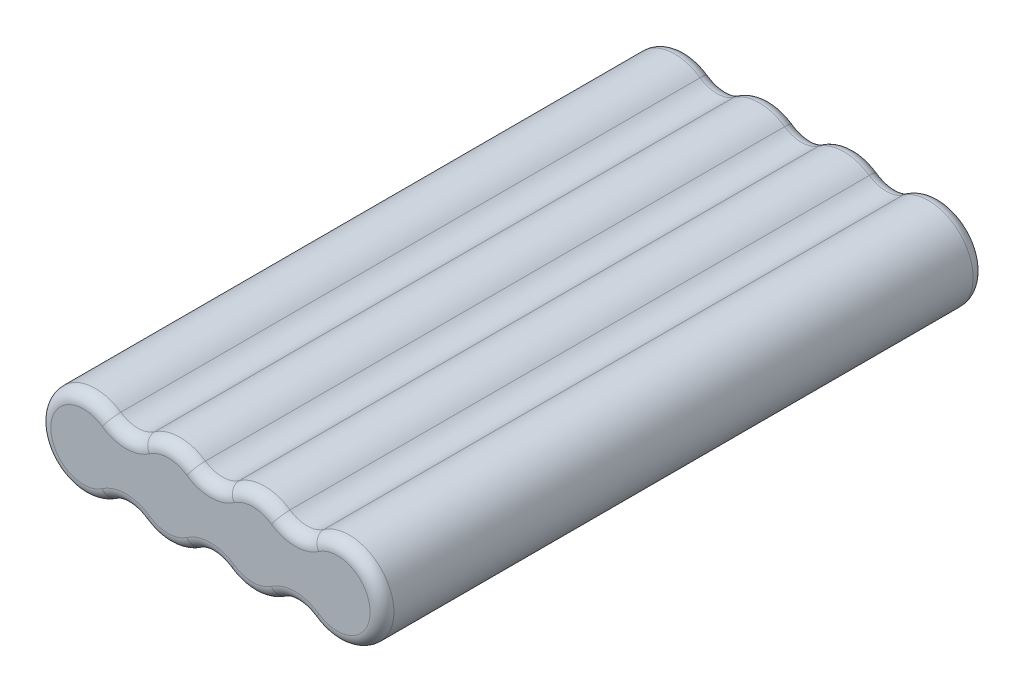
ISO-10303-21;
HEADER;
FILE_DESCRIPTION(('STEP AP214'),'2;1');
FILE_NAME('part.step','',(''),(''),'','','');
FILE_SCHEMA(('AUTOMOTIVE_DESIGN { 1 0 10303 214 1 1 1 1 }'));
ENDSEC;
DATA;
#1=APPLICATION_CONTEXT('core data for automotive mechanical design processes');
#2=APPLICATION_PROTOCOL_DEFINITION('international standard','automotive_design',2000,#1);
#3=PRODUCT_CONTEXT('',#1,'mechanical');
#4=PRODUCT('Part','Part','',(#3));
#5=PRODUCT_RELATED_PRODUCT_CATEGORY('part','',(#4));
#6=PRODUCT_DEFINITION_FORMATION('','',#4);
#7=PRODUCT_DEFINITION_CONTEXT('part definition',#1,'design');
#8=PRODUCT_DEFINITION('design','',#6,#7);
#9=PRODUCT_DEFINITION_SHAPE('','',#8);
#10=(LENGTH_UNIT() NAMED_UNIT(*) SI_UNIT(.MILLI.,.METRE.));
#11=(NAMED_UNIT(*) PLANE_ANGLE_UNIT() SI_UNIT($,.RADIAN.));
#12=(NAMED_UNIT(*) SI_UNIT($,.STERADIAN.) SOLID_ANGLE_UNIT());
#13=UNCERTAINTY_MEASURE_WITH_UNIT(LENGTH_MEASURE(1.E-05),#10,'distance_accuracy_value','');
#14=(GEOMETRIC_REPRESENTATION_CONTEXT(3) GLOBAL_UNCERTAINTY_ASSIGNED_CONTEXT((#13)) GLOBAL_UNIT_ASSIGNED_CONTEXT((#10,
#11,#12)) REPRESENTATION_CONTEXT('',''));
#15=CARTESIAN_POINT('',(0.,0.,0.));
#16=DIRECTION('',(0.,0.,1.));
#17=DIRECTION('',(1.,0.,0.));
#18=AXIS2_PLACEMENT_3D('',#15,#16,#17);
#19=CARTESIAN_POINT('',(14.2193333333333,-10.2811789153233,50.673));
#20=DIRECTION('',(0.,0.,-1.));
#21=DIRECTION('',(-1.,0.,0.));
#22=AXIS2_PLACEMENT_3D('',#19,#20,#21);
#23=CYLINDRICAL_SURFACE('',#22,5.);
#24=DIRECTION('',(0.,0.,-1.));
#25=VECTOR('',#24,1.);
#26=CARTESIAN_POINT('',(11.3754666666667,-6.16870734919399,50.673));
#27=LINE('',#26,#25);
#28=CARTESIAN_POINT('',(11.3754666666667,-6.16870734919399,48.673));
#29=VERTEX_POINT('',#28);
#30=CARTESIAN_POINT('',(11.3754666666667,-6.16870734919399,-48.673));
#31=VERTEX_POINT('',#30);
#32=EDGE_CURVE('E365',#29,#31,#27,.T.);
#33=ORIENTED_EDGE('',*,*,#32,.T.);
#34=CARTESIAN_POINT('',(14.2193333333333,-10.2811789153233,-48.673));
#35=DIRECTION('',(0.,0.,1.));
#36=DIRECTION('',(1.,0.,0.));
#37=AXIS2_PLACEMENT_3D('',#34,#35,#36);
#38=CIRCLE('',#37,5.);
#39=CARTESIAN_POINT('',(17.0632,-6.16870734919399,-48.673));
#40=VERTEX_POINT('',#39);
#41=EDGE_CURVE('E310',#31,#40,#38,.F.);
#42=ORIENTED_EDGE('',*,*,#41,.T.);
#43=DIRECTION('',(0.,0.,-1.));
#44=VECTOR('',#43,1.);
#45=CARTESIAN_POINT('',(17.0632,-6.16870734919399,50.673));
#46=LINE('',#45,#44);
#47=CARTESIAN_POINT('',(17.0632,-6.16870734919399,48.673));
#48=VERTEX_POINT('',#47);
#49=EDGE_CURVE('E225',#48,#40,#46,.T.);
#50=ORIENTED_EDGE('',*,*,#49,.F.);
#51=CARTESIAN_POINT('',(14.2193333333333,-10.2811789153233,48.673));
#52=DIRECTION('',(0.,0.,1.));
#53=DIRECTION('',(1.,0.,0.));
#54=AXIS2_PLACEMENT_3D('',#51,#52,#53);
#55=CIRCLE('',#54,5.);
#56=EDGE_CURVE('E308',#48,#29,#55,.T.);
#57=ORIENTED_EDGE('',*,*,#56,.T.);
#58=EDGE_LOOP('',(#33,#42,#50,#57));
#59=FACE_BOUND('',#58,.T.);
#60=ADVANCED_FACE('F41',(#59),#23,.F.);
#61=CARTESIAN_POINT('',(21.329,0.,50.673));
#62=DIRECTION('',(0.,0.,-1.));
#63=DIRECTION('',(-1.,0.,0.));
#64=AXIS2_PLACEMENT_3D('',#61,#62,#63);
#65=CYLINDRICAL_SURFACE('',#64,7.5);
#66=ORIENTED_EDGE('',*,*,#49,.T.);
#67=CARTESIAN_POINT('',(21.329,0.,-48.673));
#68=DIRECTION('',(0.,0.,1.));
#69=DIRECTION('',(1.,0.,0.));
#70=AXIS2_PLACEMENT_3D('',#67,#68,#69);
#71=CIRCLE('',#70,7.5);
#72=CARTESIAN_POINT('',(17.0632,6.168707349194,-48.673));
#73=VERTEX_POINT('',#72);
#74=EDGE_CURVE('E224',#40,#73,#71,.T.);
#75=ORIENTED_EDGE('',*,*,#74,.T.);
#76=DIRECTION('',(0.,0.,-1.));
#77=VECTOR('',#76,1.);
#78=CARTESIAN_POINT('',(17.0632,6.168707349194,50.673));
#79=LINE('',#78,#77);
#80=CARTESIAN_POINT('',(17.0632,6.168707349194,48.673));
#81=VERTEX_POINT('',#80);
#82=EDGE_CURVE('E206',#81,#73,#79,.T.);
#83=ORIENTED_EDGE('',*,*,#82,.F.);
#84=CARTESIAN_POINT('',(21.329,0.,48.673));
#85=DIRECTION('',(0.,0.,1.));
#86=DIRECTION('',(1.,0.,0.));
#87=AXIS2_PLACEMENT_3D('',#84,#85,#86);
#88=CIRCLE('',#87,7.5);
#89=EDGE_CURVE('E221',#81,#48,#88,.F.);
#90=ORIENTED_EDGE('',*,*,#89,.T.);
#91=EDGE_LOOP('',(#66,#75,#83,#90));
#92=FACE_BOUND('',#91,.T.);
#93=ADVANCED_FACE('F219',(#92),#65,.T.);
#94=CARTESIAN_POINT('',(14.2193333333333,10.2811789153233,50.673));
#95=DIRECTION('',(0.,0.,-1.));
#96=DIRECTION('',(-1.,0.,0.));
#97=AXIS2_PLACEMENT_3D('',#94,#95,#96);
#98=CYLINDRICAL_SURFACE('',#97,5.);
#99=ORIENTED_EDGE('',*,*,#82,.T.);
#100=CARTESIAN_POINT('',(14.2193333333333,10.2811789153233,-48.673));
#101=DIRECTION('',(0.,0.,1.));
#102=DIRECTION('',(1.,0.,0.));
#103=AXIS2_PLACEMENT_3D('',#100,#101,#102);
#104=CIRCLE('',#103,5.);
#105=CARTESIAN_POINT('',(11.3754666666667,6.168707349194,-48.673));
#106=VERTEX_POINT('',#105);
#107=EDGE_CURVE('E213',#73,#106,#104,.F.);
#108=ORIENTED_EDGE('',*,*,#107,.T.);
#109=DIRECTION('',(0.,0.,-1.));
#110=VECTOR('',#109,1.);
#111=CARTESIAN_POINT('',(11.3754666666667,6.168707349194,50.673));
#112=LINE('',#111,#110);
#113=CARTESIAN_POINT('',(11.3754666666667,6.168707349194,48.673));
#114=VERTEX_POINT('',#113);
#115=EDGE_CURVE('E208',#114,#106,#112,.T.);
#116=ORIENTED_EDGE('',*,*,#115,.F.);
#117=CARTESIAN_POINT('',(14.2193333333333,10.2811789153233,48.673));
#118=DIRECTION('',(0.,0.,1.));
#119=DIRECTION('',(1.,0.,0.));
#120=AXIS2_PLACEMENT_3D('',#117,#118,#119);
#121=CIRCLE('',#120,5.);
#122=EDGE_CURVE('E203',#114,#81,#121,.T.);
#123=ORIENTED_EDGE('',*,*,#122,.T.);
#124=EDGE_LOOP('',(#99,#108,#116,#123));
#125=FACE_BOUND('',#124,.T.);
#126=ADVANCED_FACE('F205',(#125),#98,.F.);
#127=CARTESIAN_POINT('',(7.10966666666667,0.,50.673));
#128=DIRECTION('',(0.,0.,-1.));
#129=DIRECTION('',(-1.,0.,0.));
#130=AXIS2_PLACEMENT_3D('',#127,#128,#129);
#131=CYLINDRICAL_SURFACE('',#130,7.5);
#132=ORIENTED_EDGE('',*,*,#115,.T.);
#133=CARTESIAN_POINT('',(7.10966666666667,0.,-48.673));
#134=DIRECTION('',(0.,0.,1.));
#135=DIRECTION('',(1.,0.,0.));
#136=AXIS2_PLACEMENT_3D('',#133,#134,#135);
#137=CIRCLE('',#136,7.5);
#138=CARTESIAN_POINT('',(2.84386666666667,6.168707349194,-48.673));
#139=VERTEX_POINT('',#138);
#140=EDGE_CURVE('E273',#106,#139,#137,.T.);
#141=ORIENTED_EDGE('',*,*,#140,.T.);
#142=DIRECTION('',(0.,0.,-1.));
#143=VECTOR('',#142,1.);
#144=CARTESIAN_POINT('',(2.84386666666667,6.168707349194,50.673));
#145=LINE('',#144,#143);
#146=CARTESIAN_POINT('',(2.84386666666667,6.168707349194,48.673));
#147=VERTEX_POINT('',#146);
#148=EDGE_CURVE('E415',#147,#139,#145,.T.);
#149=ORIENTED_EDGE('',*,*,#148,.F.);
#150=CARTESIAN_POINT('',(7.10966666666667,0.,48.673));
#151=DIRECTION('',(0.,0.,1.));
#152=DIRECTION('',(1.,0.,0.));
#153=AXIS2_PLACEMENT_3D('',#150,#151,#152);
#154=CIRCLE('',#153,7.5);
#155=EDGE_CURVE('E271',#147,#114,#154,.F.);
#156=ORIENTED_EDGE('',*,*,#155,.T.);
#157=EDGE_LOOP('',(#132,#141,#149,#156));
#158=FACE_BOUND('',#157,.T.);
#159=ADVANCED_FACE('F424',(#158),#131,.T.);
#160=CARTESIAN_POINT('',(0.,10.2811789153233,50.673));
#161=DIRECTION('',(0.,0.,-1.));
#162=DIRECTION('',(-1.,0.,0.));
#163=AXIS2_PLACEMENT_3D('',#160,#161,#162);
#164=CYLINDRICAL_SURFACE('',#163,5.);
#165=ORIENTED_EDGE('',*,*,#148,.T.);
#166=CARTESIAN_POINT('',(0.,10.2811789153233,-48.673));
#167=DIRECTION('',(0.,0.,1.));
#168=DIRECTION('',(1.,0.,0.));
#169=AXIS2_PLACEMENT_3D('',#166,#167,#168);
#170=CIRCLE('',#169,5.);
#171=CARTESIAN_POINT('',(-2.84386666666667,6.168707349194,-48.673));
#172=VERTEX_POINT('',#171);
#173=EDGE_CURVE('E277',#139,#172,#170,.F.);
#174=ORIENTED_EDGE('',*,*,#173,.T.);
#175=DIRECTION('',(0.,0.,-1.));
#176=VECTOR('',#175,1.);
#177=CARTESIAN_POINT('',(-2.84386666666667,6.168707349194,50.673));
#178=LINE('',#177,#176);
#179=CARTESIAN_POINT('',(-2.84386666666667,6.168707349194,48.673));
#180=VERTEX_POINT('',#179);
#181=EDGE_CURVE('E406',#180,#172,#178,.T.);
#182=ORIENTED_EDGE('',*,*,#181,.F.);
#183=CARTESIAN_POINT('',(0.,10.2811789153233,48.673));
#184=DIRECTION('',(0.,0.,1.));
#185=DIRECTION('',(1.,0.,0.));
#186=AXIS2_PLACEMENT_3D('',#183,#184,#185);
#187=CIRCLE('',#186,5.);
#188=EDGE_CURVE('E275',#180,#147,#187,.T.);
#189=ORIENTED_EDGE('',*,*,#188,.T.);
#190=EDGE_LOOP('',(#165,#174,#182,#189));
#191=FACE_BOUND('',#190,.T.);
#192=ADVANCED_FACE('F412',(#191),#164,.F.);
#193=CARTESIAN_POINT('',(-7.10966666666667,0.,50.673));
#194=DIRECTION('',(0.,0.,-1.));
#195=DIRECTION('',(-1.,0.,0.));
#196=AXIS2_PLACEMENT_3D('',#193,#194,#195);
#197=CYLINDRICAL_SURFACE('',#196,7.5);
#198=ORIENTED_EDGE('',*,*,#181,.T.);
#199=CARTESIAN_POINT('',(-7.10966666666667,0.,-48.673));
#200=DIRECTION('',(0.,0.,1.));
#201=DIRECTION('',(1.,0.,0.));
#202=AXIS2_PLACEMENT_3D('',#199,#200,#201);
#203=CIRCLE('',#202,7.5);
#204=CARTESIAN_POINT('',(-11.3754666666667,6.168707349194,-48.673));
#205=VERTEX_POINT('',#204);
#206=EDGE_CURVE('E281',#172,#205,#203,.T.);
#207=ORIENTED_EDGE('',*,*,#206,.T.);
#208=DIRECTION('',(0.,0.,-1.));
#209=VECTOR('',#208,1.);
#210=CARTESIAN_POINT('',(-11.3754666666667,6.168707349194,50.673));
#211=LINE('',#210,#209);
#212=CARTESIAN_POINT('',(-11.3754666666667,6.168707349194,48.673));
#213=VERTEX_POINT('',#212);
#214=EDGE_CURVE('E409',#213,#205,#211,.T.);
#215=ORIENTED_EDGE('',*,*,#214,.F.);
#216=CARTESIAN_POINT('',(-7.10966666666667,0.,48.673));
#217=DIRECTION('',(0.,0.,1.));
#218=DIRECTION('',(1.,0.,0.));
#219=AXIS2_PLACEMENT_3D('',#216,#217,#218);
#220=CIRCLE('',#219,7.5);
#221=EDGE_CURVE('E279',#213,#180,#220,.F.);
#222=ORIENTED_EDGE('',*,*,#221,.T.);
#223=EDGE_LOOP('',(#198,#207,#215,#222));
#224=FACE_BOUND('',#223,.T.);
#225=ADVANCED_FACE('F405',(#224),#197,.T.);
#226=CARTESIAN_POINT('',(-14.2193333333333,10.2811789153233,50.673));
#227=DIRECTION('',(0.,0.,-1.));
#228=DIRECTION('',(-1.,0.,0.));
#229=AXIS2_PLACEMENT_3D('',#226,#227,#228);
#230=CYLINDRICAL_SURFACE('',#229,5.);
#231=ORIENTED_EDGE('',*,*,#214,.T.);
#232=CARTESIAN_POINT('',(-14.2193333333333,10.2811789153233,-48.673));
#233=DIRECTION('',(0.,0.,1.));
#234=DIRECTION('',(1.,0.,0.));
#235=AXIS2_PLACEMENT_3D('',#232,#233,#234);
#236=CIRCLE('',#235,5.);
#237=CARTESIAN_POINT('',(-17.0632,6.168707349194,-48.673));
#238=VERTEX_POINT('',#237);
#239=EDGE_CURVE('E285',#205,#238,#236,.F.);
#240=ORIENTED_EDGE('',*,*,#239,.T.);
#241=DIRECTION('',(0.,0.,-1.));
#242=VECTOR('',#241,1.);
#243=CARTESIAN_POINT('',(-17.0632,6.168707349194,50.673));
#244=LINE('',#243,#242);
#245=CARTESIAN_POINT('',(-17.0632,6.168707349194,48.673));
#246=VERTEX_POINT('',#245);
#247=EDGE_CURVE('E418',#246,#238,#244,.T.);
#248=ORIENTED_EDGE('',*,*,#247,.F.);
#249=CARTESIAN_POINT('',(-14.2193333333333,10.2811789153233,48.673));
#250=DIRECTION('',(0.,0.,1.));
#251=DIRECTION('',(1.,0.,0.));
#252=AXIS2_PLACEMENT_3D('',#249,#250,#251);
#253=CIRCLE('',#252,5.);
#254=EDGE_CURVE('E283',#246,#213,#253,.T.);
#255=ORIENTED_EDGE('',*,*,#254,.T.);
#256=EDGE_LOOP('',(#231,#240,#248,#255));
#257=FACE_BOUND('',#256,.T.);
#258=ADVANCED_FACE('F750',(#257),#230,.F.);
#259=CARTESIAN_POINT('',(-21.329,0.,50.673));
#260=DIRECTION('',(0.,0.,-1.));
#261=DIRECTION('',(-1.,0.,0.));
#262=AXIS2_PLACEMENT_3D('',#259,#260,#261);
#263=CYLINDRICAL_SURFACE('',#262,7.5);
#264=ORIENTED_EDGE('',*,*,#247,.T.);
#265=CARTESIAN_POINT('',(-21.329,0.,-48.673));
#266=DIRECTION('',(0.,0.,1.));
#267=DIRECTION('',(1.,0.,0.));
#268=AXIS2_PLACEMENT_3D('',#265,#266,#267);
#269=CIRCLE('',#268,7.5);
#270=CARTESIAN_POINT('',(-17.0632,-6.16870734919399,-48.673));
#271=VERTEX_POINT('',#270);
#272=EDGE_CURVE('E289',#238,#271,#269,.T.);
#273=ORIENTED_EDGE('',*,*,#272,.T.);
#274=DIRECTION('',(0.,0.,-1.));
#275=VECTOR('',#274,1.);
#276=CARTESIAN_POINT('',(-17.0632,-6.16870734919399,50.673));
#277=LINE('',#276,#275);
#278=CARTESIAN_POINT('',(-17.0632,-6.16870734919399,48.673));
#279=VERTEX_POINT('',#278);
#280=EDGE_CURVE('E818',#279,#271,#277,.T.);
#281=ORIENTED_EDGE('',*,*,#280,.F.);
#282=CARTESIAN_POINT('',(-21.329,0.,48.673));
#283=DIRECTION('',(0.,0.,1.));
#284=DIRECTION('',(1.,0.,0.));
#285=AXIS2_PLACEMENT_3D('',#282,#283,#284);
#286=CIRCLE('',#285,7.5);
#287=EDGE_CURVE('E287',#279,#246,#286,.F.);
#288=ORIENTED_EDGE('',*,*,#287,.T.);
#289=EDGE_LOOP('',(#264,#273,#281,#288));
#290=FACE_BOUND('',#289,.T.);
#291=ADVANCED_FACE('F741',(#290),#263,.T.);
#292=CARTESIAN_POINT('',(-14.2193333333333,-10.2811789153233,50.673));
#293=DIRECTION('',(0.,0.,-1.));
#294=DIRECTION('',(-1.,0.,0.));
#295=AXIS2_PLACEMENT_3D('',#292,#293,#294);
#296=CYLINDRICAL_SURFACE('',#295,5.);
#297=ORIENTED_EDGE('',*,*,#280,.T.);
#298=CARTESIAN_POINT('',(-14.2193333333333,-10.2811789153233,-48.673));
#299=DIRECTION('',(0.,0.,1.));
#300=DIRECTION('',(1.,0.,0.));
#301=AXIS2_PLACEMENT_3D('',#298,#299,#300);
#302=CIRCLE('',#301,5.);
#303=CARTESIAN_POINT('',(-11.3754666666667,-6.16870734919399,-48.673));
#304=VERTEX_POINT('',#303);
#305=EDGE_CURVE('E293',#271,#304,#302,.F.);
#306=ORIENTED_EDGE('',*,*,#305,.T.);
#307=DIRECTION('',(0.,0.,-1.));
#308=VECTOR('',#307,1.);
#309=CARTESIAN_POINT('',(-11.3754666666667,-6.16870734919399,50.673));
#310=LINE('',#309,#308);
#311=CARTESIAN_POINT('',(-11.3754666666667,-6.16870734919399,48.673));
#312=VERTEX_POINT('',#311);
#313=EDGE_CURVE('E820',#312,#304,#310,.T.);
#314=ORIENTED_EDGE('',*,*,#313,.F.);
#315=CARTESIAN_POINT('',(-14.2193333333333,-10.2811789153233,48.673));
#316=DIRECTION('',(0.,0.,1.));
#317=DIRECTION('',(1.,0.,0.));
#318=AXIS2_PLACEMENT_3D('',#315,#316,#317);
#319=CIRCLE('',#318,5.);
#320=EDGE_CURVE('E291',#312,#279,#319,.T.);
#321=ORIENTED_EDGE('',*,*,#320,.T.);
#322=EDGE_LOOP('',(#297,#306,#314,#321));
#323=FACE_BOUND('',#322,.T.);
#324=ADVANCED_FACE('F732',(#323),#296,.F.);
#325=CARTESIAN_POINT('',(-7.10966666666667,0.,50.673));
#326=DIRECTION('',(0.,0.,-1.));
#327=DIRECTION('',(-1.,0.,0.));
#328=AXIS2_PLACEMENT_3D('',#325,#326,#327);
#329=CYLINDRICAL_SURFACE('',#328,7.5);
#330=ORIENTED_EDGE('',*,*,#313,.T.);
#331=CARTESIAN_POINT('',(-7.10966666666667,0.,-48.673));
#332=DIRECTION('',(0.,0.,1.));
#333=DIRECTION('',(1.,0.,0.));
#334=AXIS2_PLACEMENT_3D('',#331,#332,#333);
#335=CIRCLE('',#334,7.5);
#336=CARTESIAN_POINT('',(-2.84386666666667,-6.16870734919399,-48.673));
#337=VERTEX_POINT('',#336);
#338=EDGE_CURVE('E297',#304,#337,#335,.T.);
#339=ORIENTED_EDGE('',*,*,#338,.T.);
#340=DIRECTION('',(0.,0.,-1.));
#341=VECTOR('',#340,1.);
#342=CARTESIAN_POINT('',(-2.84386666666667,-6.16870734919399,50.673));
#343=LINE('',#342,#341);
#344=CARTESIAN_POINT('',(-2.84386666666667,-6.16870734919399,48.673));
#345=VERTEX_POINT('',#344);
#346=EDGE_CURVE('E825',#345,#337,#343,.T.);
#347=ORIENTED_EDGE('',*,*,#346,.F.);
#348=CARTESIAN_POINT('',(-7.10966666666667,0.,48.673));
#349=DIRECTION('',(0.,0.,1.));
#350=DIRECTION('',(1.,0.,0.));
#351=AXIS2_PLACEMENT_3D('',#348,#349,#350);
#352=CIRCLE('',#351,7.5);
#353=EDGE_CURVE('E295',#345,#312,#352,.F.);
#354=ORIENTED_EDGE('',*,*,#353,.T.);
#355=EDGE_LOOP('',(#330,#339,#347,#354));
#356=FACE_BOUND('',#355,.T.);
#357=ADVANCED_FACE('F723',(#356),#329,.T.);
#358=CARTESIAN_POINT('',(0.,-10.2811789153233,50.673));
#359=DIRECTION('',(0.,0.,-1.));
#360=DIRECTION('',(-1.,0.,0.));
#361=AXIS2_PLACEMENT_3D('',#358,#359,#360);
#362=CYLINDRICAL_SURFACE('',#361,5.);
#363=ORIENTED_EDGE('',*,*,#346,.T.);
#364=CARTESIAN_POINT('',(0.,-10.2811789153233,-48.673));
#365=DIRECTION('',(0.,0.,1.));
#366=DIRECTION('',(1.,0.,0.));
#367=AXIS2_PLACEMENT_3D('',#364,#365,#366);
#368=CIRCLE('',#367,5.);
#369=CARTESIAN_POINT('',(2.84386666666666,-6.16870734919399,-48.673));
#370=VERTEX_POINT('',#369);
#371=EDGE_CURVE('E301',#337,#370,#368,.F.);
#372=ORIENTED_EDGE('',*,*,#371,.T.);
#373=DIRECTION('',(0.,0.,-1.));
#374=VECTOR('',#373,1.);
#375=CARTESIAN_POINT('',(2.84386666666666,-6.16870734919399,50.673));
#376=LINE('',#375,#374);
#377=CARTESIAN_POINT('',(2.84386666666666,-6.16870734919399,48.673));
#378=VERTEX_POINT('',#377);
#379=EDGE_CURVE('E828',#378,#370,#376,.T.);
#380=ORIENTED_EDGE('',*,*,#379,.F.);
#381=CARTESIAN_POINT('',(0.,-10.2811789153233,48.673));
#382=DIRECTION('',(0.,0.,1.));
#383=DIRECTION('',(1.,0.,0.));
#384=AXIS2_PLACEMENT_3D('',#381,#382,#383);
#385=CIRCLE('',#384,5.);
#386=EDGE_CURVE('E299',#378,#345,#385,.T.);
#387=ORIENTED_EDGE('',*,*,#386,.T.);
#388=EDGE_LOOP('',(#363,#372,#380,#387));
#389=FACE_BOUND('',#388,.T.);
#390=ADVANCED_FACE('F714',(#389),#362,.F.);
#391=CARTESIAN_POINT('',(7.10966666666667,0.,50.673));
#392=DIRECTION('',(0.,0.,-1.));
#393=DIRECTION('',(-1.,0.,0.));
#394=AXIS2_PLACEMENT_3D('',#391,#392,#393);
#395=CYLINDRICAL_SURFACE('',#394,7.5);
#396=ORIENTED_EDGE('',*,*,#379,.T.);
#397=CARTESIAN_POINT('',(7.10966666666667,0.,-48.673));
#398=DIRECTION('',(0.,0.,1.));
#399=DIRECTION('',(1.,0.,0.));
#400=AXIS2_PLACEMENT_3D('',#397,#398,#399);
#401=CIRCLE('',#400,7.5);
#402=EDGE_CURVE('E306',#370,#31,#401,.T.);
#403=ORIENTED_EDGE('',*,*,#402,.T.);
#404=ORIENTED_EDGE('',*,*,#32,.F.);
#405=CARTESIAN_POINT('',(7.10966666666667,0.,48.673));
#406=DIRECTION('',(0.,0.,1.));
#407=DIRECTION('',(1.,0.,0.));
#408=AXIS2_PLACEMENT_3D('',#405,#406,#407);
#409=CIRCLE('',#408,7.5);
#410=EDGE_CURVE('E303',#29,#378,#409,.F.);
#411=ORIENTED_EDGE('',*,*,#410,.T.);
#412=EDGE_LOOP('',(#396,#403,#404,#411));
#413=FACE_BOUND('',#412,.T.);
#414=ADVANCED_FACE('F706',(#413),#395,.T.);
#415=CARTESIAN_POINT('',(10.6645,-5.14058945766166,50.673));
#416=DIRECTION('',(0.,0.,1.));
#417=DIRECTION('',(1.,0.,0.));
#418=AXIS2_PLACEMENT_3D('',#415,#416,#417);
#419=PLANE('',#418);
#420=CARTESIAN_POINT('',(0.,-10.2811789153233,50.673));
#421=DIRECTION('',(0.,0.,1.));
#422=DIRECTION('',(1.,0.,0.));
#423=AXIS2_PLACEMENT_3D('',#420,#421,#422);
#424=CIRCLE('',#423,7.);
#425=CARTESIAN_POINT('',(-3.98141333333334,-4.52371872274226,50.673));
#426=VERTEX_POINT('',#425);
#427=CARTESIAN_POINT('',(3.98141333333333,-4.52371872274226,50.673));
#428=VERTEX_POINT('',#427);
#429=EDGE_CURVE('E50',#426,#428,#424,.F.);
#430=ORIENTED_EDGE('',*,*,#429,.T.);
#431=CARTESIAN_POINT('',(7.10966666666667,0.,50.673));
#432=DIRECTION('',(0.,0.,1.));
#433=DIRECTION('',(1.,0.,0.));
#434=AXIS2_PLACEMENT_3D('',#431,#432,#433);
#435=CIRCLE('',#434,5.5);
#436=CARTESIAN_POINT('',(10.23792,-4.52371872274226,50.673));
#437=VERTEX_POINT('',#436);
#438=EDGE_CURVE('E11',#428,#437,#435,.T.);
#439=ORIENTED_EDGE('',*,*,#438,.T.);
#440=CARTESIAN_POINT('',(14.2193333333333,-10.2811789153233,50.673));
#441=DIRECTION('',(0.,0.,1.));
#442=DIRECTION('',(1.,0.,0.));
#443=AXIS2_PLACEMENT_3D('',#440,#441,#442);
#444=CIRCLE('',#443,7.);
#445=CARTESIAN_POINT('',(18.2007466666667,-4.52371872274226,50.673));
#446=VERTEX_POINT('',#445);
#447=EDGE_CURVE('E312',#437,#446,#444,.F.);
#448=ORIENTED_EDGE('',*,*,#447,.T.);
#449=CARTESIAN_POINT('',(21.329,0.,50.673));
#450=DIRECTION('',(0.,0.,1.));
#451=DIRECTION('',(1.,0.,0.));
#452=AXIS2_PLACEMENT_3D('',#449,#450,#451);
#453=CIRCLE('',#452,5.5);
#454=CARTESIAN_POINT('',(18.2007466666667,4.52371872274226,50.673));
#455=VERTEX_POINT('',#454);
#456=EDGE_CURVE('E314',#446,#455,#453,.T.);
#457=ORIENTED_EDGE('',*,*,#456,.T.);
#458=CARTESIAN_POINT('',(14.2193333333333,10.2811789153233,50.673));
#459=DIRECTION('',(0.,0.,1.));
#460=DIRECTION('',(1.,0.,0.));
#461=AXIS2_PLACEMENT_3D('',#458,#459,#460);
#462=CIRCLE('',#461,7.);
#463=CARTESIAN_POINT('',(10.23792,4.52371872274227,50.673));
#464=VERTEX_POINT('',#463);
#465=EDGE_CURVE('E231',#455,#464,#462,.F.);
#466=ORIENTED_EDGE('',*,*,#465,.T.);
#467=CARTESIAN_POINT('',(7.10966666666667,0.,50.673));
#468=DIRECTION('',(0.,0.,1.));
#469=DIRECTION('',(1.,0.,0.));
#470=AXIS2_PLACEMENT_3D('',#467,#468,#469);
#471=CIRCLE('',#470,5.5);
#472=CARTESIAN_POINT('',(3.98141333333333,4.52371872274227,50.673));
#473=VERTEX_POINT('',#472);
#474=EDGE_CURVE('E317',#464,#473,#471,.T.);
#475=ORIENTED_EDGE('',*,*,#474,.T.);
#476=CARTESIAN_POINT('',(0.,10.2811789153233,50.673));
#477=DIRECTION('',(0.,0.,1.));
#478=DIRECTION('',(1.,0.,0.));
#479=AXIS2_PLACEMENT_3D('',#476,#477,#478);
#480=CIRCLE('',#479,7.);
#481=CARTESIAN_POINT('',(-3.98141333333334,4.52371872274227,50.673));
#482=VERTEX_POINT('',#481);
#483=EDGE_CURVE('E319',#473,#482,#480,.F.);
#484=ORIENTED_EDGE('',*,*,#483,.T.);
#485=CARTESIAN_POINT('',(-7.10966666666667,0.,50.673));
#486=DIRECTION('',(0.,0.,1.));
#487=DIRECTION('',(1.,0.,0.));
#488=AXIS2_PLACEMENT_3D('',#485,#486,#487);
#489=CIRCLE('',#488,5.5);
#490=CARTESIAN_POINT('',(-10.23792,4.52371872274227,50.673));
#491=VERTEX_POINT('',#490);
#492=EDGE_CURVE('E321',#482,#491,#489,.T.);
#493=ORIENTED_EDGE('',*,*,#492,.T.);
#494=CARTESIAN_POINT('',(-14.2193333333333,10.2811789153233,50.673));
#495=DIRECTION('',(0.,0.,1.));
#496=DIRECTION('',(1.,0.,0.));
#497=AXIS2_PLACEMENT_3D('',#494,#495,#496);
#498=CIRCLE('',#497,7.);
#499=CARTESIAN_POINT('',(-18.2007466666667,4.52371872274227,50.673));
#500=VERTEX_POINT('',#499);
#501=EDGE_CURVE('E323',#491,#500,#498,.F.);
#502=ORIENTED_EDGE('',*,*,#501,.T.);
#503=CARTESIAN_POINT('',(-21.329,0.,50.673));
#504=DIRECTION('',(0.,0.,1.));
#505=DIRECTION('',(1.,0.,0.));
#506=AXIS2_PLACEMENT_3D('',#503,#504,#505);
#507=CIRCLE('',#506,5.5);
#508=CARTESIAN_POINT('',(-18.2007466666667,-4.52371872274226,50.673));
#509=VERTEX_POINT('',#508);
#510=EDGE_CURVE('E325',#500,#509,#507,.T.);
#511=ORIENTED_EDGE('',*,*,#510,.T.);
#512=CARTESIAN_POINT('',(-14.2193333333333,-10.2811789153233,50.673));
#513=DIRECTION('',(0.,0.,1.));
#514=DIRECTION('',(1.,0.,0.));
#515=AXIS2_PLACEMENT_3D('',#512,#513,#514);
#516=CIRCLE('',#515,7.);
#517=CARTESIAN_POINT('',(-10.23792,-4.52371872274226,50.673));
#518=VERTEX_POINT('',#517);
#519=EDGE_CURVE('E327',#509,#518,#516,.F.);
#520=ORIENTED_EDGE('',*,*,#519,.T.);
#521=CARTESIAN_POINT('',(-7.10966666666667,0.,50.673));
#522=DIRECTION('',(0.,0.,1.));
#523=DIRECTION('',(1.,0.,0.));
#524=AXIS2_PLACEMENT_3D('',#521,#522,#523);
#525=CIRCLE('',#524,5.5);
#526=EDGE_CURVE('E61',#518,#426,#525,.T.);
#527=ORIENTED_EDGE('',*,*,#526,.T.);
#528=EDGE_LOOP('',(#430,#439,#448,#457,#466,#475,#484,#493,#502,#511,#520,#527));
#529=FACE_BOUND('',#528,.T.);
#530=ADVANCED_FACE('F698',(#529),#419,.T.);
#531=CARTESIAN_POINT('',(10.6645,-5.14058945766166,-50.673));
#532=DIRECTION('',(0.,0.,1.));
#533=DIRECTION('',(1.,0.,0.));
#534=AXIS2_PLACEMENT_3D('',#531,#532,#533);
#535=PLANE('',#534);
#536=CARTESIAN_POINT('',(14.2193333333333,10.2811789153233,-50.673));
#537=DIRECTION('',(0.,0.,1.));
#538=DIRECTION('',(1.,0.,0.));
#539=AXIS2_PLACEMENT_3D('',#536,#537,#538);
#540=CIRCLE('',#539,7.);
#541=CARTESIAN_POINT('',(10.23792,4.52371872274227,-50.673));
#542=VERTEX_POINT('',#541);
#543=CARTESIAN_POINT('',(18.2007466666667,4.52371872274226,-50.673));
#544=VERTEX_POINT('',#543);
#545=EDGE_CURVE('E266',#542,#544,#540,.T.);
#546=ORIENTED_EDGE('',*,*,#545,.T.);
#547=CARTESIAN_POINT('',(21.329,0.,-50.673));
#548=DIRECTION('',(0.,0.,1.));
#549=DIRECTION('',(1.,0.,0.));
#550=AXIS2_PLACEMENT_3D('',#547,#548,#549);
#551=CIRCLE('',#550,5.5);
#552=CARTESIAN_POINT('',(18.2007466666667,-4.52371872274226,-50.673));
#553=VERTEX_POINT('',#552);
#554=EDGE_CURVE('E214',#544,#553,#551,.F.);
#555=ORIENTED_EDGE('',*,*,#554,.T.);
#556=CARTESIAN_POINT('',(14.2193333333333,-10.2811789153233,-50.673));
#557=DIRECTION('',(0.,0.,1.));
#558=DIRECTION('',(1.,0.,0.));
#559=AXIS2_PLACEMENT_3D('',#556,#557,#558);
#560=CIRCLE('',#559,7.);
#561=CARTESIAN_POINT('',(10.23792,-4.52371872274226,-50.673));
#562=VERTEX_POINT('',#561);
#563=EDGE_CURVE('E243',#553,#562,#560,.T.);
#564=ORIENTED_EDGE('',*,*,#563,.T.);
#565=CARTESIAN_POINT('',(7.10966666666667,0.,-50.673));
#566=DIRECTION('',(0.,0.,1.));
#567=DIRECTION('',(1.,0.,0.));
#568=AXIS2_PLACEMENT_3D('',#565,#566,#567);
#569=CIRCLE('',#568,5.5);
#570=CARTESIAN_POINT('',(3.98141333333333,-4.52371872274226,-50.673));
#571=VERTEX_POINT('',#570);
#572=EDGE_CURVE('E248',#562,#571,#569,.F.);
#573=ORIENTED_EDGE('',*,*,#572,.T.);
#574=CARTESIAN_POINT('',(0.,-10.2811789153233,-50.673));
#575=DIRECTION('',(0.,0.,1.));
#576=DIRECTION('',(1.,0.,0.));
#577=AXIS2_PLACEMENT_3D('',#574,#575,#576);
#578=CIRCLE('',#577,7.);
#579=CARTESIAN_POINT('',(-3.98141333333334,-4.52371872274226,-50.673));
#580=VERTEX_POINT('',#579);
#581=EDGE_CURVE('E250',#571,#580,#578,.T.);
#582=ORIENTED_EDGE('',*,*,#581,.T.);
#583=CARTESIAN_POINT('',(-7.10966666666667,0.,-50.673));
#584=DIRECTION('',(0.,0.,1.));
#585=DIRECTION('',(1.,0.,0.));
#586=AXIS2_PLACEMENT_3D('',#583,#584,#585);
#587=CIRCLE('',#586,5.5);
#588=CARTESIAN_POINT('',(-10.23792,-4.52371872274226,-50.673));
#589=VERTEX_POINT('',#588);
#590=EDGE_CURVE('E252',#580,#589,#587,.F.);
#591=ORIENTED_EDGE('',*,*,#590,.T.);
#592=CARTESIAN_POINT('',(-14.2193333333333,-10.2811789153233,-50.673));
#593=DIRECTION('',(0.,0.,1.));
#594=DIRECTION('',(1.,0.,0.));
#595=AXIS2_PLACEMENT_3D('',#592,#593,#594);
#596=CIRCLE('',#595,7.);
#597=CARTESIAN_POINT('',(-18.2007466666667,-4.52371872274226,-50.673));
#598=VERTEX_POINT('',#597);
#599=EDGE_CURVE('E254',#589,#598,#596,.T.);
#600=ORIENTED_EDGE('',*,*,#599,.T.);
#601=CARTESIAN_POINT('',(-21.329,0.,-50.673));
#602=DIRECTION('',(0.,0.,1.));
#603=DIRECTION('',(1.,0.,0.));
#604=AXIS2_PLACEMENT_3D('',#601,#602,#603);
#605=CIRCLE('',#604,5.5);
#606=CARTESIAN_POINT('',(-18.2007466666667,4.52371872274227,-50.673));
#607=VERTEX_POINT('',#606);
#608=EDGE_CURVE('E256',#598,#607,#605,.F.);
#609=ORIENTED_EDGE('',*,*,#608,.T.);
#610=CARTESIAN_POINT('',(-14.2193333333333,10.2811789153233,-50.673));
#611=DIRECTION('',(0.,0.,1.));
#612=DIRECTION('',(1.,0.,0.));
#613=AXIS2_PLACEMENT_3D('',#610,#611,#612);
#614=CIRCLE('',#613,7.);
#615=CARTESIAN_POINT('',(-10.23792,4.52371872274227,-50.673));
#616=VERTEX_POINT('',#615);
#617=EDGE_CURVE('E258',#607,#616,#614,.T.);
#618=ORIENTED_EDGE('',*,*,#617,.T.);
#619=CARTESIAN_POINT('',(-7.10966666666667,0.,-50.673));
#620=DIRECTION('',(0.,0.,1.));
#621=DIRECTION('',(1.,0.,0.));
#622=AXIS2_PLACEMENT_3D('',#619,#620,#621);
#623=CIRCLE('',#622,5.5);
#624=CARTESIAN_POINT('',(-3.98141333333334,4.52371872274227,-50.673));
#625=VERTEX_POINT('',#624);
#626=EDGE_CURVE('E260',#616,#625,#623,.F.);
#627=ORIENTED_EDGE('',*,*,#626,.T.);
#628=CARTESIAN_POINT('',(0.,10.2811789153233,-50.673));
#629=DIRECTION('',(0.,0.,1.));
#630=DIRECTION('',(1.,0.,0.));
#631=AXIS2_PLACEMENT_3D('',#628,#629,#630);
#632=CIRCLE('',#631,7.);
#633=CARTESIAN_POINT('',(3.98141333333333,4.52371872274227,-50.673));
#634=VERTEX_POINT('',#633);
#635=EDGE_CURVE('E262',#625,#634,#632,.T.);
#636=ORIENTED_EDGE('',*,*,#635,.T.);
#637=CARTESIAN_POINT('',(7.10966666666667,0.,-50.673));
#638=DIRECTION('',(0.,0.,1.));
#639=DIRECTION('',(1.,0.,0.));
#640=AXIS2_PLACEMENT_3D('',#637,#638,#639);
#641=CIRCLE('',#640,5.5);
#642=EDGE_CURVE('E264',#634,#542,#641,.F.);
#643=ORIENTED_EDGE('',*,*,#642,.T.);
#644=EDGE_LOOP('',(#546,#555,#564,#573,#582,#591,#600,#609,#618,#627,#636,#643));
#645=FACE_BOUND('',#644,.T.);
#646=ADVANCED_FACE('F438',(#645),#535,.F.);
#647=CARTESIAN_POINT('',(-21.329,0.,-48.673));
#648=DIRECTION('',(0.,0.,1.));
#649=DIRECTION('',(1.,0.,0.));
#650=AXIS2_PLACEMENT_3D('',#647,#648,#649);
#651=TOROIDAL_SURFACE('',#650,5.5,2.);
#652=CARTESIAN_POINT('',(-18.2007466666667,4.52371872274227,-48.673));
#653=DIRECTION('',(0.822494313225866,-0.568773333333333,0.));
#654=DIRECTION('',(0.568773333333333,0.822494313225866,0.));
#655=AXIS2_PLACEMENT_3D('',#652,#653,#654);
#656=CIRCLE('',#655,2.);
#657=EDGE_CURVE('E359',#607,#238,#656,.T.);
#658=ORIENTED_EDGE('',*,*,#657,.F.);
#659=ORIENTED_EDGE('',*,*,#608,.F.);
#660=CARTESIAN_POINT('',(-18.2007466666667,-4.52371872274226,-48.673));
#661=DIRECTION('',(0.822494313225866,0.568773333333333,0.));
#662=DIRECTION('',(-0.568773333333333,0.822494313225866,0.));
#663=AXIS2_PLACEMENT_3D('',#660,#661,#662);
#664=CIRCLE('',#663,2.);
#665=EDGE_CURVE('E362',#271,#598,#664,.T.);
#666=ORIENTED_EDGE('',*,*,#665,.F.);
#667=ORIENTED_EDGE('',*,*,#272,.F.);
#668=EDGE_LOOP('',(#658,#659,#666,#667));
#669=FACE_BOUND('',#668,.T.);
#670=ADVANCED_FACE('F470',(#669),#651,.T.);
#671=CARTESIAN_POINT('',(-14.2193333333333,-10.2811789153233,-48.673));
#672=DIRECTION('',(0.,0.,1.));
#673=DIRECTION('',(1.,0.,0.));
#674=AXIS2_PLACEMENT_3D('',#671,#672,#673);
#675=TOROIDAL_SURFACE('',#674,7.,2.);
#676=ORIENTED_EDGE('',*,*,#665,.T.);
#677=ORIENTED_EDGE('',*,*,#599,.F.);
#678=CARTESIAN_POINT('',(-10.23792,-4.52371872274226,-48.673));
#679=DIRECTION('',(0.822494313225866,-0.568773333333333,0.));
#680=DIRECTION('',(0.568773333333333,0.822494313225866,0.));
#681=AXIS2_PLACEMENT_3D('',#678,#679,#680);
#682=CIRCLE('',#681,2.);
#683=EDGE_CURVE('E356',#304,#589,#682,.T.);
#684=ORIENTED_EDGE('',*,*,#683,.F.);
#685=ORIENTED_EDGE('',*,*,#305,.F.);
#686=EDGE_LOOP('',(#676,#677,#684,#685));
#687=FACE_BOUND('',#686,.T.);
#688=ADVANCED_FACE('F465',(#687),#675,.T.);
#689=CARTESIAN_POINT('',(-14.2193333333333,10.2811789153233,-48.673));
#690=DIRECTION('',(0.,0.,1.));
#691=DIRECTION('',(1.,0.,0.));
#692=AXIS2_PLACEMENT_3D('',#689,#690,#691);
#693=TOROIDAL_SURFACE('',#692,7.,2.);
#694=ORIENTED_EDGE('',*,*,#657,.T.);
#695=ORIENTED_EDGE('',*,*,#239,.F.);
#696=CARTESIAN_POINT('',(-10.23792,4.52371872274227,-48.673));
#697=DIRECTION('',(0.822494313225866,0.568773333333333,0.));
#698=DIRECTION('',(-0.568773333333333,0.822494313225866,0.));
#699=AXIS2_PLACEMENT_3D('',#696,#697,#698);
#700=CIRCLE('',#699,2.);
#701=EDGE_CURVE('E353',#616,#205,#700,.T.);
#702=ORIENTED_EDGE('',*,*,#701,.F.);
#703=ORIENTED_EDGE('',*,*,#617,.F.);
#704=EDGE_LOOP('',(#694,#695,#702,#703));
#705=FACE_BOUND('',#704,.T.);
#706=ADVANCED_FACE('F476',(#705),#693,.T.);
#707=CARTESIAN_POINT('',(-7.10966666666667,0.,-48.673));
#708=DIRECTION('',(0.,0.,1.));
#709=DIRECTION('',(1.,0.,0.));
#710=AXIS2_PLACEMENT_3D('',#707,#708,#709);
#711=TOROIDAL_SURFACE('',#710,5.5,2.);
#712=ORIENTED_EDGE('',*,*,#683,.T.);
#713=ORIENTED_EDGE('',*,*,#590,.F.);
#714=CARTESIAN_POINT('',(-3.98141333333334,-4.52371872274226,-48.673));
#715=DIRECTION('',(0.822494313225866,0.568773333333333,0.));
#716=DIRECTION('',(-0.568773333333333,0.822494313225866,0.));
#717=AXIS2_PLACEMENT_3D('',#714,#715,#716);
#718=CIRCLE('',#717,2.);
#719=EDGE_CURVE('E350',#337,#580,#718,.T.);
#720=ORIENTED_EDGE('',*,*,#719,.F.);
#721=ORIENTED_EDGE('',*,*,#338,.F.);
#722=EDGE_LOOP('',(#712,#713,#720,#721));
#723=FACE_BOUND('',#722,.T.);
#724=ADVANCED_FACE('F460',(#723),#711,.T.);
#725=CARTESIAN_POINT('',(-7.10966666666667,0.,-48.673));
#726=DIRECTION('',(0.,0.,1.));
#727=DIRECTION('',(1.,0.,0.));
#728=AXIS2_PLACEMENT_3D('',#725,#726,#727);
#729=TOROIDAL_SURFACE('',#728,5.5,2.);
#730=ORIENTED_EDGE('',*,*,#701,.T.);
#731=ORIENTED_EDGE('',*,*,#206,.F.);
#732=CARTESIAN_POINT('',(-3.98141333333334,4.52371872274227,-48.673));
#733=DIRECTION('',(0.822494313225866,-0.568773333333334,0.));
#734=DIRECTION('',(0.568773333333334,0.822494313225866,0.));
#735=AXIS2_PLACEMENT_3D('',#732,#733,#734);
#736=CIRCLE('',#735,2.);
#737=EDGE_CURVE('E347',#625,#172,#736,.T.);
#738=ORIENTED_EDGE('',*,*,#737,.F.);
#739=ORIENTED_EDGE('',*,*,#626,.F.);
#740=EDGE_LOOP('',(#730,#731,#738,#739));
#741=FACE_BOUND('',#740,.T.);
#742=ADVANCED_FACE('F481',(#741),#729,.T.);
#743=CARTESIAN_POINT('',(0.,-10.2811789153233,-48.673));
#744=DIRECTION('',(0.,0.,1.));
#745=DIRECTION('',(1.,0.,0.));
#746=AXIS2_PLACEMENT_3D('',#743,#744,#745);
#747=TOROIDAL_SURFACE('',#746,7.,2.);
#748=ORIENTED_EDGE('',*,*,#719,.T.);
#749=ORIENTED_EDGE('',*,*,#581,.F.);
#750=CARTESIAN_POINT('',(3.98141333333333,-4.52371872274226,-48.673));
#751=DIRECTION('',(0.822494313225866,-0.568773333333334,0.));
#752=DIRECTION('',(0.568773333333334,0.822494313225866,0.));
#753=AXIS2_PLACEMENT_3D('',#750,#751,#752);
#754=CIRCLE('',#753,2.);
#755=EDGE_CURVE('E344',#370,#571,#754,.T.);
#756=ORIENTED_EDGE('',*,*,#755,.F.);
#757=ORIENTED_EDGE('',*,*,#371,.F.);
#758=EDGE_LOOP('',(#748,#749,#756,#757));
#759=FACE_BOUND('',#758,.T.);
#760=ADVANCED_FACE('F455',(#759),#747,.T.);
#761=CARTESIAN_POINT('',(0.,10.2811789153233,-48.673));
#762=DIRECTION('',(0.,0.,1.));
#763=DIRECTION('',(1.,0.,0.));
#764=AXIS2_PLACEMENT_3D('',#761,#762,#763);
#765=TOROIDAL_SURFACE('',#764,7.,2.);
#766=ORIENTED_EDGE('',*,*,#737,.T.);
#767=ORIENTED_EDGE('',*,*,#173,.F.);
#768=CARTESIAN_POINT('',(3.98141333333333,4.52371872274227,-48.673));
#769=DIRECTION('',(0.822494313225866,0.568773333333333,0.));
#770=DIRECTION('',(-0.568773333333333,0.822494313225866,0.));
#771=AXIS2_PLACEMENT_3D('',#768,#769,#770);
#772=CIRCLE('',#771,2.);
#773=EDGE_CURVE('E341',#634,#139,#772,.T.);
#774=ORIENTED_EDGE('',*,*,#773,.F.);
#775=ORIENTED_EDGE('',*,*,#635,.F.);
#776=EDGE_LOOP('',(#766,#767,#774,#775));
#777=FACE_BOUND('',#776,.T.);
#778=ADVANCED_FACE('F483',(#777),#765,.T.);
#779=CARTESIAN_POINT('',(7.10966666666667,0.,-48.673));
#780=DIRECTION('',(0.,0.,1.));
#781=DIRECTION('',(1.,0.,0.));
#782=AXIS2_PLACEMENT_3D('',#779,#780,#781);
#783=TOROIDAL_SURFACE('',#782,5.5,2.);
#784=ORIENTED_EDGE('',*,*,#755,.T.);
#785=ORIENTED_EDGE('',*,*,#572,.F.);
#786=CARTESIAN_POINT('',(10.23792,-4.52371872274226,-48.673));
#787=DIRECTION('',(0.822494313225866,0.568773333333333,0.));
#788=DIRECTION('',(-0.568773333333333,0.822494313225866,0.));
#789=AXIS2_PLACEMENT_3D('',#786,#787,#788);
#790=CIRCLE('',#789,2.);
#791=EDGE_CURVE('E338',#31,#562,#790,.T.);
#792=ORIENTED_EDGE('',*,*,#791,.F.);
#793=ORIENTED_EDGE('',*,*,#402,.F.);
#794=EDGE_LOOP('',(#784,#785,#792,#793));
#795=FACE_BOUND('',#794,.T.);
#796=ADVANCED_FACE('F450',(#795),#783,.T.);
#797=CARTESIAN_POINT('',(7.10966666666667,0.,-48.673));
#798=DIRECTION('',(0.,0.,1.));
#799=DIRECTION('',(1.,0.,0.));
#800=AXIS2_PLACEMENT_3D('',#797,#798,#799);
#801=TOROIDAL_SURFACE('',#800,5.5,2.);
#802=ORIENTED_EDGE('',*,*,#773,.T.);
#803=ORIENTED_EDGE('',*,*,#140,.F.);
#804=CARTESIAN_POINT('',(10.23792,4.52371872274227,-48.673));
#805=DIRECTION('',(0.822494313225865,-0.568773333333334,0.));
#806=DIRECTION('',(0.568773333333334,0.822494313225866,0.));
#807=AXIS2_PLACEMENT_3D('',#804,#805,#806);
#808=CIRCLE('',#807,2.);
#809=EDGE_CURVE('E335',#542,#106,#808,.T.);
#810=ORIENTED_EDGE('',*,*,#809,.F.);
#811=ORIENTED_EDGE('',*,*,#642,.F.);
#812=EDGE_LOOP('',(#802,#803,#810,#811));
#813=FACE_BOUND('',#812,.T.);
#814=ADVANCED_FACE('F428',(#813),#801,.T.);
#815=CARTESIAN_POINT('',(14.2193333333333,-10.2811789153233,-48.673));
#816=DIRECTION('',(0.,0.,1.));
#817=DIRECTION('',(1.,0.,0.));
#818=AXIS2_PLACEMENT_3D('',#815,#816,#817);
#819=TOROIDAL_SURFACE('',#818,7.,2.);
#820=ORIENTED_EDGE('',*,*,#791,.T.);
#821=ORIENTED_EDGE('',*,*,#563,.F.);
#822=CARTESIAN_POINT('',(18.2007466666667,-4.52371872274226,-48.673));
#823=DIRECTION('',(0.822494313225866,-0.568773333333333,0.));
#824=DIRECTION('',(0.568773333333333,0.822494313225866,0.));
#825=AXIS2_PLACEMENT_3D('',#822,#823,#824);
#826=CIRCLE('',#825,2.);
#827=EDGE_CURVE('E333',#40,#553,#826,.T.);
#828=ORIENTED_EDGE('',*,*,#827,.F.);
#829=ORIENTED_EDGE('',*,*,#41,.F.);
#830=EDGE_LOOP('',(#820,#821,#828,#829));
#831=FACE_BOUND('',#830,.T.);
#832=ADVANCED_FACE('F445',(#831),#819,.T.);
#833=CARTESIAN_POINT('',(14.2193333333333,10.2811789153233,-48.673));
#834=DIRECTION('',(0.,0.,1.));
#835=DIRECTION('',(1.,0.,0.));
#836=AXIS2_PLACEMENT_3D('',#833,#834,#835);
#837=TOROIDAL_SURFACE('',#836,7.,2.);
#838=ORIENTED_EDGE('',*,*,#809,.T.);
#839=ORIENTED_EDGE('',*,*,#107,.F.);
#840=CARTESIAN_POINT('',(18.2007466666667,4.52371872274226,-48.673));
#841=DIRECTION('',(0.822494313225866,0.568773333333333,0.));
#842=DIRECTION('',(-0.568773333333333,0.822494313225866,0.));
#843=AXIS2_PLACEMENT_3D('',#840,#841,#842);
#844=CIRCLE('',#843,2.);
#845=EDGE_CURVE('E331',#544,#73,#844,.T.);
#846=ORIENTED_EDGE('',*,*,#845,.F.);
#847=ORIENTED_EDGE('',*,*,#545,.F.);
#848=EDGE_LOOP('',(#838,#839,#846,#847));
#849=FACE_BOUND('',#848,.T.);
#850=ADVANCED_FACE('F434',(#849),#837,.T.);
#851=CARTESIAN_POINT('',(21.329,0.,-48.673));
#852=DIRECTION('',(0.,0.,1.));
#853=DIRECTION('',(1.,0.,0.));
#854=AXIS2_PLACEMENT_3D('',#851,#852,#853);
#855=TOROIDAL_SURFACE('',#854,5.5,2.);
#856=ORIENTED_EDGE('',*,*,#827,.T.);
#857=ORIENTED_EDGE('',*,*,#554,.F.);
#858=ORIENTED_EDGE('',*,*,#845,.T.);
#859=ORIENTED_EDGE('',*,*,#74,.F.);
#860=EDGE_LOOP('',(#856,#857,#858,#859));
#861=FACE_BOUND('',#860,.T.);
#862=ADVANCED_FACE('F440',(#861),#855,.T.);
#863=CARTESIAN_POINT('',(-7.10966666666667,0.,48.673));
#864=DIRECTION('',(0.,0.,1.));
#865=DIRECTION('',(1.,0.,0.));
#866=AXIS2_PLACEMENT_3D('',#863,#864,#865);
#867=TOROIDAL_SURFACE('',#866,5.5,2.);
#868=CARTESIAN_POINT('',(-3.98141333333334,4.52371872274227,48.673));
#869=DIRECTION('',(0.822494313225866,-0.568773333333333,0.));
#870=DIRECTION('',(0.568773333333333,0.822494313225866,0.));
#871=AXIS2_PLACEMENT_3D('',#868,#869,#870);
#872=CIRCLE('',#871,2.);
#873=EDGE_CURVE('E385',#180,#482,#872,.T.);
#874=ORIENTED_EDGE('',*,*,#873,.F.);
#875=ORIENTED_EDGE('',*,*,#221,.F.);
#876=CARTESIAN_POINT('',(-10.23792,4.52371872274227,48.673));
#877=DIRECTION('',(-0.822494313225866,-0.568773333333333,0.));
#878=DIRECTION('',(0.568773333333333,-0.822494313225866,0.));
#879=AXIS2_PLACEMENT_3D('',#876,#877,#878);
#880=CIRCLE('',#879,2.);
#881=EDGE_CURVE('E45',#491,#213,#880,.T.);
#882=ORIENTED_EDGE('',*,*,#881,.F.);
#883=ORIENTED_EDGE('',*,*,#492,.F.);
#884=EDGE_LOOP('',(#874,#875,#882,#883));
#885=FACE_BOUND('',#884,.T.);
#886=ADVANCED_FACE('F43',(#885),#867,.T.);
#887=CARTESIAN_POINT('',(-14.2193333333333,10.2811789153233,48.673));
#888=DIRECTION('',(0.,0.,1.));
#889=DIRECTION('',(1.,0.,0.));
#890=AXIS2_PLACEMENT_3D('',#887,#888,#889);
#891=TOROIDAL_SURFACE('',#890,7.,2.);
#892=ORIENTED_EDGE('',*,*,#881,.T.);
#893=ORIENTED_EDGE('',*,*,#254,.F.);
#894=CARTESIAN_POINT('',(-18.2007466666667,4.52371872274227,48.673));
#895=DIRECTION('',(-0.822494313225866,0.568773333333333,0.));
#896=DIRECTION('',(-0.568773333333333,-0.822494313225866,0.));
#897=AXIS2_PLACEMENT_3D('',#894,#895,#896);
#898=CIRCLE('',#897,2.);
#899=EDGE_CURVE('E383',#500,#246,#898,.T.);
#900=ORIENTED_EDGE('',*,*,#899,.F.);
#901=ORIENTED_EDGE('',*,*,#501,.F.);
#902=EDGE_LOOP('',(#892,#893,#900,#901));
#903=FACE_BOUND('',#902,.T.);
#904=ADVANCED_FACE('F396',(#903),#891,.T.);
#905=CARTESIAN_POINT('',(0.,10.2811789153233,48.673));
#906=DIRECTION('',(0.,0.,1.));
#907=DIRECTION('',(1.,0.,0.));
#908=AXIS2_PLACEMENT_3D('',#905,#906,#907);
#909=TOROIDAL_SURFACE('',#908,7.,2.);
#910=ORIENTED_EDGE('',*,*,#873,.T.);
#911=ORIENTED_EDGE('',*,*,#483,.F.);
#912=CARTESIAN_POINT('',(3.98141333333333,4.52371872274227,48.673));
#913=DIRECTION('',(0.822494313225865,0.568773333333334,0.));
#914=DIRECTION('',(-0.568773333333334,0.822494313225866,0.));
#915=AXIS2_PLACEMENT_3D('',#912,#913,#914);
#916=CIRCLE('',#915,2.);
#917=EDGE_CURVE('E380',#147,#473,#916,.T.);
#918=ORIENTED_EDGE('',*,*,#917,.F.);
#919=ORIENTED_EDGE('',*,*,#188,.F.);
#920=EDGE_LOOP('',(#910,#911,#918,#919));
#921=FACE_BOUND('',#920,.T.);
#922=ADVANCED_FACE('F536',(#921),#909,.T.);
#923=CARTESIAN_POINT('',(-21.329,0.,48.673));
#924=DIRECTION('',(0.,0.,1.));
#925=DIRECTION('',(1.,0.,0.));
#926=AXIS2_PLACEMENT_3D('',#923,#924,#925);
#927=TOROIDAL_SURFACE('',#926,5.5,2.);
#928=ORIENTED_EDGE('',*,*,#899,.T.);
#929=ORIENTED_EDGE('',*,*,#287,.F.);
#930=CARTESIAN_POINT('',(-18.2007466666667,-4.52371872274226,48.673));
#931=DIRECTION('',(0.822494313225866,0.568773333333333,0.));
#932=DIRECTION('',(-0.568773333333333,0.822494313225866,0.));
#933=AXIS2_PLACEMENT_3D('',#930,#931,#932);
#934=CIRCLE('',#933,2.);
#935=EDGE_CURVE('E377',#509,#279,#934,.T.);
#936=ORIENTED_EDGE('',*,*,#935,.F.);
#937=ORIENTED_EDGE('',*,*,#510,.F.);
#938=EDGE_LOOP('',(#928,#929,#936,#937));
#939=FACE_BOUND('',#938,.T.);
#940=ADVANCED_FACE('F542',(#939),#927,.T.);
#941=CARTESIAN_POINT('',(7.10966666666667,0.,48.673));
#942=DIRECTION('',(0.,0.,1.));
#943=DIRECTION('',(1.,0.,0.));
#944=AXIS2_PLACEMENT_3D('',#941,#942,#943);
#945=TOROIDAL_SURFACE('',#944,5.5,2.);
#946=ORIENTED_EDGE('',*,*,#917,.T.);
#947=ORIENTED_EDGE('',*,*,#474,.F.);
#948=CARTESIAN_POINT('',(10.23792,4.52371872274227,48.673));
#949=DIRECTION('',(0.822494313225866,-0.568773333333333,0.));
#950=DIRECTION('',(0.568773333333333,0.822494313225866,0.));
#951=AXIS2_PLACEMENT_3D('',#948,#949,#950);
#952=CIRCLE('',#951,2.);
#953=EDGE_CURVE('E375',#114,#464,#952,.T.);
#954=ORIENTED_EDGE('',*,*,#953,.F.);
#955=ORIENTED_EDGE('',*,*,#155,.F.);
#956=EDGE_LOOP('',(#946,#947,#954,#955));
#957=FACE_BOUND('',#956,.T.);
#958=ADVANCED_FACE('F549',(#957),#945,.T.);
#959=CARTESIAN_POINT('',(-14.2193333333333,-10.2811789153233,48.673));
#960=DIRECTION('',(0.,0.,1.));
#961=DIRECTION('',(1.,0.,0.));
#962=AXIS2_PLACEMENT_3D('',#959,#960,#961);
#963=TOROIDAL_SURFACE('',#962,7.,2.);
#964=ORIENTED_EDGE('',*,*,#935,.T.);
#965=ORIENTED_EDGE('',*,*,#320,.F.);
#966=CARTESIAN_POINT('',(-10.23792,-4.52371872274226,48.673));
#967=DIRECTION('',(0.822494313225866,-0.568773333333333,0.));
#968=DIRECTION('',(0.568773333333333,0.822494313225866,0.));
#969=AXIS2_PLACEMENT_3D('',#966,#967,#968);
#970=CIRCLE('',#969,2.);
#971=EDGE_CURVE('E234',#518,#312,#970,.T.);
#972=ORIENTED_EDGE('',*,*,#971,.F.);
#973=ORIENTED_EDGE('',*,*,#519,.F.);
#974=EDGE_LOOP('',(#964,#965,#972,#973));
#975=FACE_BOUND('',#974,.T.);
#976=ADVANCED_FACE('F557',(#975),#963,.T.);
#977=CARTESIAN_POINT('',(14.2193333333333,10.2811789153233,48.673));
#978=DIRECTION('',(0.,0.,1.));
#979=DIRECTION('',(1.,0.,0.));
#980=AXIS2_PLACEMENT_3D('',#977,#978,#979);
#981=TOROIDAL_SURFACE('',#980,7.,2.);
#982=ORIENTED_EDGE('',*,*,#953,.T.);
#983=ORIENTED_EDGE('',*,*,#465,.F.);
#984=CARTESIAN_POINT('',(18.2007466666667,4.52371872274226,48.673));
#985=DIRECTION('',(0.822494313225866,0.568773333333333,0.));
#986=DIRECTION('',(-0.568773333333333,0.822494313225866,0.));
#987=AXIS2_PLACEMENT_3D('',#984,#985,#986);
#988=CIRCLE('',#987,2.);
#989=EDGE_CURVE('E229',#81,#455,#988,.T.);
#990=ORIENTED_EDGE('',*,*,#989,.F.);
#991=ORIENTED_EDGE('',*,*,#122,.F.);
#992=EDGE_LOOP('',(#982,#983,#990,#991));
#993=FACE_BOUND('',#992,.T.);
#994=ADVANCED_FACE('F230',(#993),#981,.T.);
#995=CARTESIAN_POINT('',(-7.10966666666667,0.,48.673));
#996=DIRECTION('',(0.,0.,1.));
#997=DIRECTION('',(1.,0.,0.));
#998=AXIS2_PLACEMENT_3D('',#995,#996,#997);
#999=TOROIDAL_SURFACE('',#998,5.5,2.);
#1000=ORIENTED_EDGE('',*,*,#971,.T.);
#1001=ORIENTED_EDGE('',*,*,#353,.F.);
#1002=CARTESIAN_POINT('',(-3.98141333333334,-4.52371872274226,48.673));
#1003=DIRECTION('',(0.822494313225865,0.568773333333334,0.));
#1004=DIRECTION('',(-0.568773333333334,0.822494313225866,0.));
#1005=AXIS2_PLACEMENT_3D('',#1002,#1003,#1004);
#1006=CIRCLE('',#1005,2.);
#1007=EDGE_CURVE('E235',#426,#345,#1006,.T.);
#1008=ORIENTED_EDGE('',*,*,#1007,.F.);
#1009=ORIENTED_EDGE('',*,*,#526,.F.);
#1010=EDGE_LOOP('',(#1000,#1001,#1008,#1009));
#1011=FACE_BOUND('',#1010,.T.);
#1012=ADVANCED_FACE('F572',(#1011),#999,.T.);
#1013=CARTESIAN_POINT('',(21.329,0.,48.673));
#1014=DIRECTION('',(0.,0.,1.));
#1015=DIRECTION('',(1.,0.,0.));
#1016=AXIS2_PLACEMENT_3D('',#1013,#1014,#1015);
#1017=TOROIDAL_SURFACE('',#1016,5.5,2.);
#1018=ORIENTED_EDGE('',*,*,#989,.T.);
#1019=ORIENTED_EDGE('',*,*,#456,.F.);
#1020=CARTESIAN_POINT('',(18.2007466666667,-4.52371872274226,48.673));
#1021=DIRECTION('',(-0.822494313225866,0.568773333333333,0.));
#1022=DIRECTION('',(-0.568773333333333,-0.822494313225866,0.));
#1023=AXIS2_PLACEMENT_3D('',#1020,#1021,#1022);
#1024=CIRCLE('',#1023,2.);
#1025=EDGE_CURVE('E240',#48,#446,#1024,.T.);
#1026=ORIENTED_EDGE('',*,*,#1025,.F.);
#1027=ORIENTED_EDGE('',*,*,#89,.F.);
#1028=EDGE_LOOP('',(#1018,#1019,#1026,#1027));
#1029=FACE_BOUND('',#1028,.T.);
#1030=ADVANCED_FACE('F238',(#1029),#1017,.T.);
#1031=CARTESIAN_POINT('',(0.,-10.2811789153233,48.673));
#1032=DIRECTION('',(0.,0.,1.));
#1033=DIRECTION('',(1.,0.,0.));
#1034=AXIS2_PLACEMENT_3D('',#1031,#1032,#1033);
#1035=TOROIDAL_SURFACE('',#1034,7.,2.);
#1036=ORIENTED_EDGE('',*,*,#1007,.T.);
#1037=ORIENTED_EDGE('',*,*,#386,.F.);
#1038=CARTESIAN_POINT('',(3.98141333333333,-4.52371872274226,48.673));
#1039=DIRECTION('',(0.822494313225866,-0.568773333333334,0.));
#1040=DIRECTION('',(0.568773333333334,0.822494313225866,0.));
#1041=AXIS2_PLACEMENT_3D('',#1038,#1039,#1040);
#1042=CIRCLE('',#1041,2.);
#1043=EDGE_CURVE('E368',#428,#378,#1042,.T.);
#1044=ORIENTED_EDGE('',*,*,#1043,.F.);
#1045=ORIENTED_EDGE('',*,*,#429,.F.);
#1046=EDGE_LOOP('',(#1036,#1037,#1044,#1045));
#1047=FACE_BOUND('',#1046,.T.);
#1048=ADVANCED_FACE('F586',(#1047),#1035,.T.);
#1049=CARTESIAN_POINT('',(14.2193333333333,-10.2811789153233,48.673));
#1050=DIRECTION('',(0.,0.,1.));
#1051=DIRECTION('',(1.,0.,0.));
#1052=AXIS2_PLACEMENT_3D('',#1049,#1050,#1051);
#1053=TOROIDAL_SURFACE('',#1052,7.,2.);
#1054=ORIENTED_EDGE('',*,*,#1025,.T.);
#1055=ORIENTED_EDGE('',*,*,#447,.F.);
#1056=CARTESIAN_POINT('',(10.23792,-4.52371872274226,48.673));
#1057=DIRECTION('',(-0.822494313225865,-0.568773333333334,0.));
#1058=DIRECTION('',(0.568773333333334,-0.822494313225866,0.));
#1059=AXIS2_PLACEMENT_3D('',#1056,#1057,#1058);
#1060=CIRCLE('',#1059,2.);
#1061=EDGE_CURVE('E366',#29,#437,#1060,.T.);
#1062=ORIENTED_EDGE('',*,*,#1061,.F.);
#1063=ORIENTED_EDGE('',*,*,#56,.F.);
#1064=EDGE_LOOP('',(#1054,#1055,#1062,#1063));
#1065=FACE_BOUND('',#1064,.T.);
#1066=ADVANCED_FACE('F593',(#1065),#1053,.T.);
#1067=CARTESIAN_POINT('',(7.10966666666667,0.,48.673));
#1068=DIRECTION('',(0.,0.,1.));
#1069=DIRECTION('',(1.,0.,0.));
#1070=AXIS2_PLACEMENT_3D('',#1067,#1068,#1069);
#1071=TOROIDAL_SURFACE('',#1070,5.5,2.);
#1072=ORIENTED_EDGE('',*,*,#1043,.T.);
#1073=ORIENTED_EDGE('',*,*,#410,.F.);
#1074=ORIENTED_EDGE('',*,*,#1061,.T.);
#1075=ORIENTED_EDGE('',*,*,#438,.F.);
#1076=EDGE_LOOP('',(#1072,#1073,#1074,#1075));
#1077=FACE_BOUND('',#1076,.T.);
#1078=ADVANCED_FACE('F601',(#1077),#1071,.T.);
#1079=CLOSED_SHELL('',(#60,#93,#126,#159,#192,#225,#258,#291,#324,#357,#390,#414,#530,#646,#670,
#688,#706,#724,#742,#760,#778,#796,#814,#832,#850,#862,#886,#904,#922,#940,#958,#976,#994,#1012,
#1030,#1048,#1066,#1078));
#1080=MANIFOLD_SOLID_BREP('B2',#1079);
#1081=ADVANCED_BREP_SHAPE_REPRESENTATION('',(#18,#1080),#14);
#1082=SHAPE_DEFINITION_REPRESENTATION(#9,#1081);
ENDSEC;
END-ISO-10303-21;
